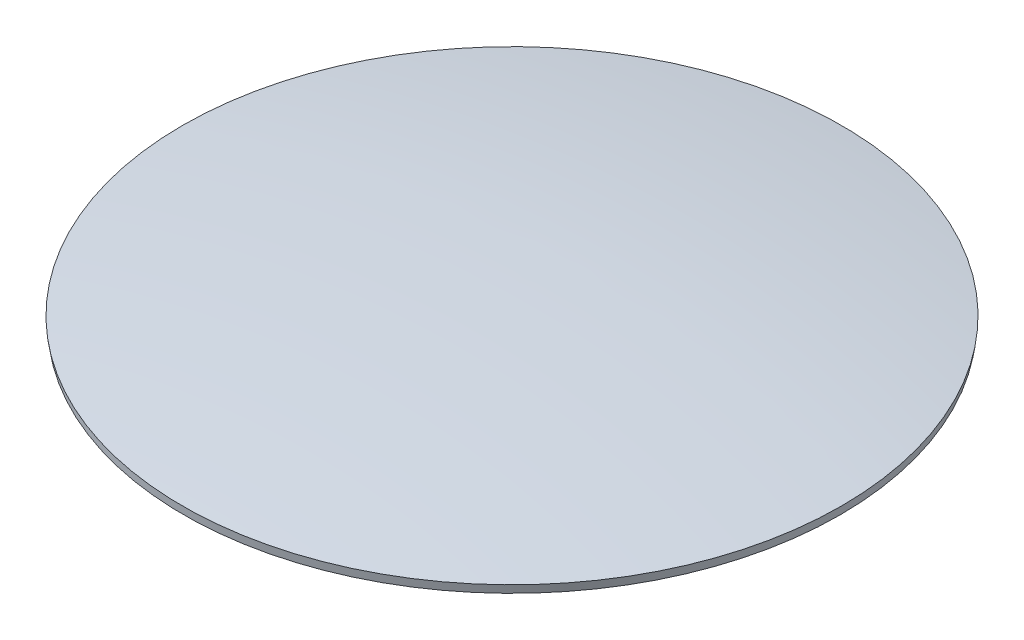
ISO-10303-21;
HEADER;
FILE_DESCRIPTION(('STEP AP214'),'2;1');
FILE_NAME('part.step','',(''),(''),'','','');
FILE_SCHEMA(('AUTOMOTIVE_DESIGN { 1 0 10303 214 1 1 1 1 }'));
ENDSEC;
DATA;
#1=APPLICATION_CONTEXT('core data for automotive mechanical design processes');
#2=APPLICATION_PROTOCOL_DEFINITION('international standard','automotive_design',2000,#1);
#3=PRODUCT_CONTEXT('',#1,'mechanical');
#4=PRODUCT('Part','Part','',(#3));
#5=PRODUCT_RELATED_PRODUCT_CATEGORY('part','',(#4));
#6=PRODUCT_DEFINITION_FORMATION('','',#4);
#7=PRODUCT_DEFINITION_CONTEXT('part definition',#1,'design');
#8=PRODUCT_DEFINITION('design','',#6,#7);
#9=PRODUCT_DEFINITION_SHAPE('','',#8);
#10=(LENGTH_UNIT() NAMED_UNIT(*) SI_UNIT(.MILLI.,.METRE.));
#11=(NAMED_UNIT(*) PLANE_ANGLE_UNIT() SI_UNIT($,.RADIAN.));
#12=(NAMED_UNIT(*) SI_UNIT($,.STERADIAN.) SOLID_ANGLE_UNIT());
#13=UNCERTAINTY_MEASURE_WITH_UNIT(LENGTH_MEASURE(1.E-05),#10,'distance_accuracy_value','');
#14=(GEOMETRIC_REPRESENTATION_CONTEXT(3) GLOBAL_UNCERTAINTY_ASSIGNED_CONTEXT((#13)) GLOBAL_UNIT_ASSIGNED_CONTEXT((#10,
#11,#12)) REPRESENTATION_CONTEXT('',''));
#15=CARTESIAN_POINT('',(0.,0.,0.));
#16=DIRECTION('',(0.,0.,1.));
#17=DIRECTION('',(1.,0.,0.));
#18=AXIS2_PLACEMENT_3D('',#15,#16,#17);
#19=CARTESIAN_POINT('',(0.,-125.003964161656,0.));
#20=DIRECTION('',(0.,1.,0.));
#21=DIRECTION('',(1.,0.,0.));
#22=AXIS2_PLACEMENT_3D('',#19,#20,#21);
#23=SPHERICAL_SURFACE('',#22,127.003964161657);
#24=CARTESIAN_POINT('',(0.,0.49407133203331,0.));
#25=DIRECTION('',(0.,1.,0.));
#26=DIRECTION('',(-1.,0.,0.));
#27=AXIS2_PLACEMENT_3D('',#24,#25,#26);
#28=CIRCLE('',#27,19.5);
#29=CARTESIAN_POINT('',(-19.5,0.494071332033199,0.));
#30=VERTEX_POINT('',#29);
#31=EDGE_CURVE('E10',#30,#30,#28,.T.);
#32=ORIENTED_EDGE('',*,*,#31,.T.);
#33=EDGE_LOOP('',(#32));
#34=FACE_BOUND('',#33,.T.);
#35=ADVANCED_FACE('F35',(#34),#23,.T.);
#36=CARTESIAN_POINT('',(0.,0.49407133203331,0.));
#37=DIRECTION('',(0.,1.,0.));
#38=DIRECTION('',(-1.,0.,0.));
#39=AXIS2_PLACEMENT_3D('',#36,#37,#38);
#40=CONICAL_SURFACE('',#39,19.5,0.154148260103067);
#41=CARTESIAN_POINT('',(0.,1.11022302462516E-13,0.));
#42=DIRECTION('',(0.,1.,0.));
#43=DIRECTION('',(-1.,0.,0.));
#44=AXIS2_PLACEMENT_3D('',#41,#42,#43);
#45=CIRCLE('',#44,19.4232307427224);
#46=CARTESIAN_POINT('',(-19.4232307427224,0.,0.));
#47=VERTEX_POINT('',#46);
#48=EDGE_CURVE('E41',#47,#47,#45,.T.);
#49=ORIENTED_EDGE('',*,*,#48,.T.);
#50=EDGE_LOOP('',(#49));
#51=FACE_BOUND('',#50,.T.);
#52=ORIENTED_EDGE('',*,*,#31,.F.);
#53=EDGE_LOOP('',(#52));
#54=FACE_BOUND('',#53,.T.);
#55=ADVANCED_FACE('F47',(#51,#54),#40,.T.);
#56=CARTESIAN_POINT('',(0.,-125.003964161656,0.));
#57=DIRECTION('',(0.,1.,0.));
#58=DIRECTION('',(-1.,0.,0.));
#59=AXIS2_PLACEMENT_3D('',#56,#57,#58);
#60=SPHERICAL_SURFACE('',#59,126.503964161657);
#61=ORIENTED_EDGE('',*,*,#48,.F.);
#62=EDGE_LOOP('',(#61));
#63=FACE_BOUND('',#62,.T.);
#64=ADVANCED_FACE('F50',(#63),#60,.F.);
#65=CLOSED_SHELL('',(#35,#55,#64));
#66=MANIFOLD_SOLID_BREP('B2',#65);
#67=ADVANCED_BREP_SHAPE_REPRESENTATION('',(#18,#66),#14);
#68=SHAPE_DEFINITION_REPRESENTATION(#9,#67);
ENDSEC;
END-ISO-10303-21;
